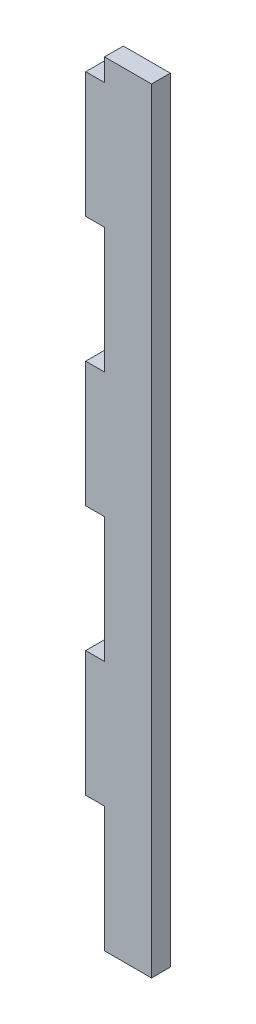
ISO-10303-21;
HEADER;
FILE_DESCRIPTION(('STEP AP214'),'2;1');
FILE_NAME('part.step','',(''),(''),'','','');
FILE_SCHEMA(('AUTOMOTIVE_DESIGN { 1 0 10303 214 1 1 1 1 }'));
ENDSEC;
DATA;
#1=APPLICATION_CONTEXT('core data for automotive mechanical design processes');
#2=APPLICATION_PROTOCOL_DEFINITION('international standard','automotive_design',2000,#1);
#3=PRODUCT_CONTEXT('',#1,'mechanical');
#4=PRODUCT('Part','Part','',(#3));
#5=PRODUCT_RELATED_PRODUCT_CATEGORY('part','',(#4));
#6=PRODUCT_DEFINITION_FORMATION('','',#4);
#7=PRODUCT_DEFINITION_CONTEXT('part definition',#1,'design');
#8=PRODUCT_DEFINITION('design','',#6,#7);
#9=PRODUCT_DEFINITION_SHAPE('','',#8);
#10=(LENGTH_UNIT() NAMED_UNIT(*) SI_UNIT(.MILLI.,.METRE.));
#11=(NAMED_UNIT(*) PLANE_ANGLE_UNIT() SI_UNIT($,.RADIAN.));
#12=(NAMED_UNIT(*) SI_UNIT($,.STERADIAN.) SOLID_ANGLE_UNIT());
#13=UNCERTAINTY_MEASURE_WITH_UNIT(LENGTH_MEASURE(1.E-05),#10,'distance_accuracy_value','');
#14=(GEOMETRIC_REPRESENTATION_CONTEXT(3) GLOBAL_UNCERTAINTY_ASSIGNED_CONTEXT((#13)) GLOBAL_UNIT_ASSIGNED_CONTEXT((#10,
#11,#12)) REPRESENTATION_CONTEXT('',''));
#15=CARTESIAN_POINT('',(0.,0.,0.));
#16=DIRECTION('',(0.,0.,1.));
#17=DIRECTION('',(1.,0.,0.));
#18=AXIS2_PLACEMENT_3D('',#15,#16,#17);
#19=CARTESIAN_POINT('',(2.64624382820718E-13,-25.6919761374694,-6.));
#20=DIRECTION('',(0.,-1.,0.));
#21=DIRECTION('',(1.,0.,0.));
#22=AXIS2_PLACEMENT_3D('',#19,#20,#21);
#23=PLANE('',#22);
#24=DIRECTION('',(1.,0.,0.));
#25=VECTOR('',#24,1.);
#26=CARTESIAN_POINT('',(2.64624382820718E-13,-25.6919761374694,0.));
#27=LINE('',#26,#25);
#28=CARTESIAN_POINT('',(-5.99999999999945,-25.6919761374694,0.));
#29=VERTEX_POINT('',#28);
#30=CARTESIAN_POINT('',(2.64624382820718E-13,-25.6919761374694,0.));
#31=VERTEX_POINT('',#30);
#32=EDGE_CURVE('E177',#29,#31,#27,.T.);
#33=ORIENTED_EDGE('',*,*,#32,.F.);
#34=DIRECTION('',(0.,0.,1.));
#35=VECTOR('',#34,1.);
#36=CARTESIAN_POINT('',(-5.99999999999945,-25.6919761374694,-6.));
#37=LINE('',#36,#35);
#38=CARTESIAN_POINT('',(-5.99999999999945,-25.6919761374694,-6.));
#39=VERTEX_POINT('',#38);
#40=EDGE_CURVE('E11',#39,#29,#37,.T.);
#41=ORIENTED_EDGE('',*,*,#40,.F.);
#42=DIRECTION('',(1.,0.,0.));
#43=VECTOR('',#42,1.);
#44=CARTESIAN_POINT('',(2.64624382820718E-13,-25.6919761374694,-6.));
#45=LINE('',#44,#43);
#46=CARTESIAN_POINT('',(2.64624382820718E-13,-25.6919761374694,-6.));
#47=VERTEX_POINT('',#46);
#48=EDGE_CURVE('E221',#39,#47,#45,.T.);
#49=ORIENTED_EDGE('',*,*,#48,.T.);
#50=DIRECTION('',(0.,0.,1.));
#51=VECTOR('',#50,1.);
#52=CARTESIAN_POINT('',(2.64624382820718E-13,-25.6919761374694,-6.));
#53=LINE('',#52,#51);
#54=EDGE_CURVE('E35',#47,#31,#53,.T.);
#55=ORIENTED_EDGE('',*,*,#54,.T.);
#56=EDGE_LOOP('',(#33,#41,#49,#55));
#57=FACE_BOUND('',#56,.T.);
#58=ADVANCED_FACE('F32',(#57),#23,.T.);
#59=CARTESIAN_POINT('',(-5.99999999999934,14.3068090031227,-6.));
#60=DIRECTION('',(-1.,0.,0.));
#61=DIRECTION('',(0.,-1.,0.));
#62=AXIS2_PLACEMENT_3D('',#59,#60,#61);
#63=PLANE('',#62);
#64=DIRECTION('',(0.,-1.,0.));
#65=VECTOR('',#64,1.);
#66=CARTESIAN_POINT('',(-5.99999999999934,14.3068090031227,0.));
#67=LINE('',#66,#65);
#68=CARTESIAN_POINT('',(-5.99999999999934,14.3068090031227,0.));
#69=VERTEX_POINT('',#68);
#70=EDGE_CURVE('E219',#69,#29,#67,.T.);
#71=ORIENTED_EDGE('',*,*,#70,.F.);
#72=DIRECTION('',(0.,0.,1.));
#73=VECTOR('',#72,1.);
#74=CARTESIAN_POINT('',(-5.99999999999934,14.3068090031227,-6.));
#75=LINE('',#74,#73);
#76=CARTESIAN_POINT('',(-5.99999999999934,14.3068090031227,-6.));
#77=VERTEX_POINT('',#76);
#78=EDGE_CURVE('E41',#77,#69,#75,.T.);
#79=ORIENTED_EDGE('',*,*,#78,.F.);
#80=DIRECTION('',(0.,-1.,0.));
#81=VECTOR('',#80,1.);
#82=CARTESIAN_POINT('',(-5.99999999999934,14.3068090031227,-6.));
#83=LINE('',#82,#81);
#84=EDGE_CURVE('E167',#77,#39,#83,.T.);
#85=ORIENTED_EDGE('',*,*,#84,.T.);
#86=ORIENTED_EDGE('',*,*,#40,.T.);
#87=EDGE_LOOP('',(#71,#79,#85,#86));
#88=FACE_BOUND('',#87,.T.);
#89=ADVANCED_FACE('F249',(#88),#63,.T.);
#90=CARTESIAN_POINT('',(-5.99999999999934,14.3068090031227,-6.));
#91=DIRECTION('',(0.,1.,0.));
#92=DIRECTION('',(-1.,0.,0.));
#93=AXIS2_PLACEMENT_3D('',#90,#91,#92);
#94=PLANE('',#93);
#95=DIRECTION('',(-1.,0.,0.));
#96=VECTOR('',#95,1.);
#97=CARTESIAN_POINT('',(-5.99999999999934,14.3068090031227,0.));
#98=LINE('',#97,#96);
#99=CARTESIAN_POINT('',(4.44089209850063E-13,14.3068090031227,0.));
#100=VERTEX_POINT('',#99);
#101=EDGE_CURVE('E154',#100,#69,#98,.T.);
#102=ORIENTED_EDGE('',*,*,#101,.F.);
#103=DIRECTION('',(0.,0.,1.));
#104=VECTOR('',#103,1.);
#105=CARTESIAN_POINT('',(4.44089209850063E-13,14.3068090031227,-6.));
#106=LINE('',#105,#104);
#107=CARTESIAN_POINT('',(4.44089209850063E-13,14.3068090031227,-6.));
#108=VERTEX_POINT('',#107);
#109=EDGE_CURVE('E149',#108,#100,#106,.T.);
#110=ORIENTED_EDGE('',*,*,#109,.F.);
#111=DIRECTION('',(-1.,0.,0.));
#112=VECTOR('',#111,1.);
#113=CARTESIAN_POINT('',(-5.99999999999934,14.3068090031227,-6.));
#114=LINE('',#113,#112);
#115=EDGE_CURVE('E152',#108,#77,#114,.T.);
#116=ORIENTED_EDGE('',*,*,#115,.T.);
#117=ORIENTED_EDGE('',*,*,#78,.T.);
#118=EDGE_LOOP('',(#102,#110,#116,#117));
#119=FACE_BOUND('',#118,.T.);
#120=ADVANCED_FACE('F151',(#119),#94,.T.);
#121=CARTESIAN_POINT('',(4.44089209850063E-13,14.3068090031227,-6.));
#122=DIRECTION('',(-1.,0.,0.));
#123=DIRECTION('',(0.,-1.,0.));
#124=AXIS2_PLACEMENT_3D('',#121,#122,#123);
#125=PLANE('',#124);
#126=DIRECTION('',(0.,-1.,0.));
#127=VECTOR('',#126,1.);
#128=CARTESIAN_POINT('',(4.44089209850063E-13,14.3068090031227,0.));
#129=LINE('',#128,#127);
#130=CARTESIAN_POINT('',(0.,54.3086312922345,0.));
#131=VERTEX_POINT('',#130);
#132=EDGE_CURVE('E216',#131,#100,#129,.T.);
#133=ORIENTED_EDGE('',*,*,#132,.F.);
#134=DIRECTION('',(0.,0.,1.));
#135=VECTOR('',#134,1.);
#136=CARTESIAN_POINT('',(0.,54.3086312922345,-6.));
#137=LINE('',#136,#135);
#138=CARTESIAN_POINT('',(0.,54.3086312922345,-6.));
#139=VERTEX_POINT('',#138);
#140=EDGE_CURVE('E159',#139,#131,#137,.T.);
#141=ORIENTED_EDGE('',*,*,#140,.F.);
#142=DIRECTION('',(0.,-1.,0.));
#143=VECTOR('',#142,1.);
#144=CARTESIAN_POINT('',(4.44089209850063E-13,14.3068090031227,-6.));
#145=LINE('',#144,#143);
#146=EDGE_CURVE('E165',#139,#108,#145,.T.);
#147=ORIENTED_EDGE('',*,*,#146,.T.);
#148=ORIENTED_EDGE('',*,*,#109,.T.);
#149=EDGE_LOOP('',(#133,#141,#147,#148));
#150=FACE_BOUND('',#149,.T.);
#151=ADVANCED_FACE('F169',(#150),#125,.T.);
#152=CARTESIAN_POINT('',(-5.99999999999973,54.3086312922345,-6.));
#153=DIRECTION('',(0.,-1.,0.));
#154=DIRECTION('',(0.,0.,-1.));
#155=AXIS2_PLACEMENT_3D('',#152,#153,#154);
#156=PLANE('',#155);
#157=DIRECTION('',(1.,0.,0.));
#158=VECTOR('',#157,1.);
#159=CARTESIAN_POINT('',(-5.99999999999973,54.3086312922345,0.));
#160=LINE('',#159,#158);
#161=CARTESIAN_POINT('',(-5.99999999999973,54.3086312922345,0.));
#162=VERTEX_POINT('',#161);
#163=EDGE_CURVE('E213',#162,#131,#160,.T.);
#164=ORIENTED_EDGE('',*,*,#163,.F.);
#165=DIRECTION('',(0.,0.,1.));
#166=VECTOR('',#165,1.);
#167=CARTESIAN_POINT('',(-5.99999999999973,54.3086312922345,-6.));
#168=LINE('',#167,#166);
#169=CARTESIAN_POINT('',(-5.99999999999973,54.3086312922345,-6.));
#170=VERTEX_POINT('',#169);
#171=EDGE_CURVE('E225',#170,#162,#168,.T.);
#172=ORIENTED_EDGE('',*,*,#171,.F.);
#173=DIRECTION('',(1.,0.,0.));
#174=VECTOR('',#173,1.);
#175=CARTESIAN_POINT('',(-5.99999999999973,54.3086312922345,-6.));
#176=LINE('',#175,#174);
#177=EDGE_CURVE('E170',#170,#139,#176,.T.);
#178=ORIENTED_EDGE('',*,*,#177,.T.);
#179=ORIENTED_EDGE('',*,*,#140,.T.);
#180=EDGE_LOOP('',(#164,#172,#178,#179));
#181=FACE_BOUND('',#180,.T.);
#182=ADVANCED_FACE('F262',(#181),#156,.T.);
#183=CARTESIAN_POINT('',(-5.99999999999961,94.3074164328267,-6.));
#184=DIRECTION('',(-1.,0.,0.));
#185=DIRECTION('',(0.,-1.,0.));
#186=AXIS2_PLACEMENT_3D('',#183,#184,#185);
#187=PLANE('',#186);
#188=DIRECTION('',(0.,-1.,0.));
#189=VECTOR('',#188,1.);
#190=CARTESIAN_POINT('',(-5.99999999999961,94.3074164328267,0.));
#191=LINE('',#190,#189);
#192=CARTESIAN_POINT('',(-5.99999999999961,94.3074164328267,0.));
#193=VERTEX_POINT('',#192);
#194=EDGE_CURVE('E210',#193,#162,#191,.T.);
#195=ORIENTED_EDGE('',*,*,#194,.F.);
#196=DIRECTION('',(0.,0.,1.));
#197=VECTOR('',#196,1.);
#198=CARTESIAN_POINT('',(-5.99999999999961,94.3074164328267,-6.));
#199=LINE('',#198,#197);
#200=CARTESIAN_POINT('',(-5.99999999999961,94.3074164328267,-6.));
#201=VERTEX_POINT('',#200);
#202=EDGE_CURVE('E227',#201,#193,#199,.T.);
#203=ORIENTED_EDGE('',*,*,#202,.F.);
#204=DIRECTION('',(0.,-1.,0.));
#205=VECTOR('',#204,1.);
#206=CARTESIAN_POINT('',(-5.99999999999961,94.3074164328267,-6.));
#207=LINE('',#206,#205);
#208=EDGE_CURVE('E172',#201,#170,#207,.T.);
#209=ORIENTED_EDGE('',*,*,#208,.T.);
#210=ORIENTED_EDGE('',*,*,#171,.T.);
#211=EDGE_LOOP('',(#195,#203,#209,#210));
#212=FACE_BOUND('',#211,.T.);
#213=ADVANCED_FACE('F265',(#212),#187,.T.);
#214=CARTESIAN_POINT('',(-5.99999999999961,94.3074164328267,-6.));
#215=DIRECTION('',(0.,1.,0.));
#216=DIRECTION('',(0.,0.,1.));
#217=AXIS2_PLACEMENT_3D('',#214,#215,#216);
#218=PLANE('',#217);
#219=DIRECTION('',(-1.,0.,0.));
#220=VECTOR('',#219,1.);
#221=CARTESIAN_POINT('',(-5.99999999999961,94.3074164328267,0.));
#222=LINE('',#221,#220);
#223=CARTESIAN_POINT('',(1.69667206304067E-13,94.3074164328267,0.));
#224=VERTEX_POINT('',#223);
#225=EDGE_CURVE('E207',#224,#193,#222,.T.);
#226=ORIENTED_EDGE('',*,*,#225,.F.);
#227=DIRECTION('',(0.,0.,1.));
#228=VECTOR('',#227,1.);
#229=CARTESIAN_POINT('',(1.69667206304067E-13,94.3074164328267,-6.));
#230=LINE('',#229,#228);
#231=CARTESIAN_POINT('',(1.69667206304067E-13,94.3074164328267,-6.));
#232=VERTEX_POINT('',#231);
#233=EDGE_CURVE('E229',#232,#224,#230,.T.);
#234=ORIENTED_EDGE('',*,*,#233,.F.);
#235=DIRECTION('',(-1.,0.,0.));
#236=VECTOR('',#235,1.);
#237=CARTESIAN_POINT('',(-5.99999999999961,94.3074164328267,-6.));
#238=LINE('',#237,#236);
#239=EDGE_CURVE('E446',#232,#201,#238,.T.);
#240=ORIENTED_EDGE('',*,*,#239,.T.);
#241=ORIENTED_EDGE('',*,*,#202,.T.);
#242=EDGE_LOOP('',(#226,#234,#240,#241));
#243=FACE_BOUND('',#242,.T.);
#244=ADVANCED_FACE('F269',(#243),#218,.T.);
#245=CARTESIAN_POINT('',(1.69667206304067E-13,94.3074164328267,-6.));
#246=DIRECTION('',(-1.,0.,0.));
#247=DIRECTION('',(0.,-1.,0.));
#248=AXIS2_PLACEMENT_3D('',#245,#246,#247);
#249=PLANE('',#248);
#250=DIRECTION('',(0.,-1.,0.));
#251=VECTOR('',#250,1.);
#252=CARTESIAN_POINT('',(1.69667206304067E-13,94.3074164328267,0.));
#253=LINE('',#252,#251);
#254=CARTESIAN_POINT('',(-2.8421962427128E-13,134.309238721938,0.));
#255=VERTEX_POINT('',#254);
#256=EDGE_CURVE('E204',#255,#224,#253,.T.);
#257=ORIENTED_EDGE('',*,*,#256,.F.);
#258=DIRECTION('',(0.,0.,1.));
#259=VECTOR('',#258,1.);
#260=CARTESIAN_POINT('',(-2.8421962427128E-13,134.309238721938,-6.));
#261=LINE('',#260,#259);
#262=CARTESIAN_POINT('',(-2.8421962427128E-13,134.309238721938,-6.));
#263=VERTEX_POINT('',#262);
#264=EDGE_CURVE('E231',#263,#255,#261,.T.);
#265=ORIENTED_EDGE('',*,*,#264,.F.);
#266=DIRECTION('',(0.,-1.,0.));
#267=VECTOR('',#266,1.);
#268=CARTESIAN_POINT('',(1.69667206304067E-13,94.3074164328267,-6.));
#269=LINE('',#268,#267);
#270=EDGE_CURVE('E442',#263,#232,#269,.T.);
#271=ORIENTED_EDGE('',*,*,#270,.T.);
#272=ORIENTED_EDGE('',*,*,#233,.T.);
#273=EDGE_LOOP('',(#257,#265,#271,#272));
#274=FACE_BOUND('',#273,.T.);
#275=ADVANCED_FACE('F273',(#274),#249,.T.);
#276=CARTESIAN_POINT('',(-6.,134.309238721938,-6.));
#277=DIRECTION('',(0.,-1.,0.));
#278=DIRECTION('',(0.,0.,-1.));
#279=AXIS2_PLACEMENT_3D('',#276,#277,#278);
#280=PLANE('',#279);
#281=DIRECTION('',(1.,0.,0.));
#282=VECTOR('',#281,1.);
#283=CARTESIAN_POINT('',(-6.,134.309238721938,0.));
#284=LINE('',#283,#282);
#285=CARTESIAN_POINT('',(-6.,134.309238721938,0.));
#286=VERTEX_POINT('',#285);
#287=EDGE_CURVE('E201',#286,#255,#284,.T.);
#288=ORIENTED_EDGE('',*,*,#287,.F.);
#289=DIRECTION('',(0.,0.,1.));
#290=VECTOR('',#289,1.);
#291=CARTESIAN_POINT('',(-6.,134.309238721938,-6.));
#292=LINE('',#291,#290);
#293=CARTESIAN_POINT('',(-6.,134.309238721938,-6.));
#294=VERTEX_POINT('',#293);
#295=EDGE_CURVE('E233',#294,#286,#292,.T.);
#296=ORIENTED_EDGE('',*,*,#295,.F.);
#297=DIRECTION('',(1.,0.,0.));
#298=VECTOR('',#297,1.);
#299=CARTESIAN_POINT('',(-6.,134.309238721938,-6.));
#300=LINE('',#299,#298);
#301=EDGE_CURVE('E453',#294,#263,#300,.T.);
#302=ORIENTED_EDGE('',*,*,#301,.T.);
#303=ORIENTED_EDGE('',*,*,#264,.T.);
#304=EDGE_LOOP('',(#288,#296,#302,#303));
#305=FACE_BOUND('',#304,.T.);
#306=ADVANCED_FACE('F277',(#305),#280,.T.);
#307=CARTESIAN_POINT('',(-5.99999999999989,174.308023862531,-6.));
#308=DIRECTION('',(-1.,0.,0.));
#309=DIRECTION('',(0.,-1.,0.));
#310=AXIS2_PLACEMENT_3D('',#307,#308,#309);
#311=PLANE('',#310);
#312=DIRECTION('',(0.,-1.,0.));
#313=VECTOR('',#312,1.);
#314=CARTESIAN_POINT('',(-5.99999999999989,174.308023862531,0.));
#315=LINE('',#314,#313);
#316=CARTESIAN_POINT('',(-5.99999999999989,174.308023862531,0.));
#317=VERTEX_POINT('',#316);
#318=EDGE_CURVE('E198',#317,#286,#315,.T.);
#319=ORIENTED_EDGE('',*,*,#318,.F.);
#320=DIRECTION('',(0.,0.,1.));
#321=VECTOR('',#320,1.);
#322=CARTESIAN_POINT('',(-5.99999999999989,174.308023862531,-6.));
#323=LINE('',#322,#321);
#324=CARTESIAN_POINT('',(-5.99999999999989,174.308023862531,-6.));
#325=VERTEX_POINT('',#324);
#326=EDGE_CURVE('E235',#325,#317,#323,.T.);
#327=ORIENTED_EDGE('',*,*,#326,.F.);
#328=DIRECTION('',(0.,-1.,0.));
#329=VECTOR('',#328,1.);
#330=CARTESIAN_POINT('',(-5.99999999999989,174.308023862531,-6.));
#331=LINE('',#330,#329);
#332=EDGE_CURVE('E435',#325,#294,#331,.T.);
#333=ORIENTED_EDGE('',*,*,#332,.T.);
#334=ORIENTED_EDGE('',*,*,#295,.T.);
#335=EDGE_LOOP('',(#319,#327,#333,#334));
#336=FACE_BOUND('',#335,.T.);
#337=ADVANCED_FACE('F281',(#336),#311,.T.);
#338=CARTESIAN_POINT('',(-5.99999999999989,174.308023862531,-6.));
#339=DIRECTION('',(0.,1.,0.));
#340=DIRECTION('',(-1.,0.,0.));
#341=AXIS2_PLACEMENT_3D('',#338,#339,#340);
#342=PLANE('',#341);
#343=DIRECTION('',(-1.,0.,0.));
#344=VECTOR('',#343,1.);
#345=CARTESIAN_POINT('',(-5.99999999999989,174.308023862531,0.));
#346=LINE('',#345,#344);
#347=CARTESIAN_POINT('',(0.,174.308023862531,0.));
#348=VERTEX_POINT('',#347);
#349=EDGE_CURVE('E195',#348,#317,#346,.T.);
#350=ORIENTED_EDGE('',*,*,#349,.F.);
#351=DIRECTION('',(0.,0.,1.));
#352=VECTOR('',#351,1.);
#353=CARTESIAN_POINT('',(0.,174.308023862531,-6.));
#354=LINE('',#353,#352);
#355=CARTESIAN_POINT('',(0.,174.308023862531,-6.));
#356=VERTEX_POINT('',#355);
#357=EDGE_CURVE('E237',#356,#348,#354,.T.);
#358=ORIENTED_EDGE('',*,*,#357,.F.);
#359=DIRECTION('',(-1.,0.,0.));
#360=VECTOR('',#359,1.);
#361=CARTESIAN_POINT('',(-5.99999999999989,174.308023862531,-6.));
#362=LINE('',#361,#360);
#363=EDGE_CURVE('E431',#356,#325,#362,.T.);
#364=ORIENTED_EDGE('',*,*,#363,.T.);
#365=ORIENTED_EDGE('',*,*,#326,.T.);
#366=EDGE_LOOP('',(#350,#358,#364,#365));
#367=FACE_BOUND('',#366,.T.);
#368=ADVANCED_FACE('F285',(#367),#342,.T.);
#369=CARTESIAN_POINT('',(0.,181.409908734668,-6.));
#370=DIRECTION('',(-1.,0.,0.));
#371=DIRECTION('',(0.,-1.,0.));
#372=AXIS2_PLACEMENT_3D('',#369,#370,#371);
#373=PLANE('',#372);
#374=DIRECTION('',(0.,-1.,0.));
#375=VECTOR('',#374,1.);
#376=CARTESIAN_POINT('',(0.,181.409908734668,0.));
#377=LINE('',#376,#375);
#378=CARTESIAN_POINT('',(0.,181.409908734668,0.));
#379=VERTEX_POINT('',#378);
#380=EDGE_CURVE('E192',#379,#348,#377,.T.);
#381=ORIENTED_EDGE('',*,*,#380,.F.);
#382=DIRECTION('',(0.,0.,1.));
#383=VECTOR('',#382,1.);
#384=CARTESIAN_POINT('',(0.,181.409908734668,-6.));
#385=LINE('',#384,#383);
#386=CARTESIAN_POINT('',(0.,181.409908734668,-6.));
#387=VERTEX_POINT('',#386);
#388=EDGE_CURVE('E239',#387,#379,#385,.T.);
#389=ORIENTED_EDGE('',*,*,#388,.F.);
#390=DIRECTION('',(0.,-1.,0.));
#391=VECTOR('',#390,1.);
#392=CARTESIAN_POINT('',(0.,181.409908734668,-6.));
#393=LINE('',#392,#391);
#394=EDGE_CURVE('E457',#387,#356,#393,.T.);
#395=ORIENTED_EDGE('',*,*,#394,.T.);
#396=ORIENTED_EDGE('',*,*,#357,.T.);
#397=EDGE_LOOP('',(#381,#389,#395,#396));
#398=FACE_BOUND('',#397,.T.);
#399=ADVANCED_FACE('F289',(#398),#373,.T.);
#400=CARTESIAN_POINT('',(0.,181.409908734668,-6.));
#401=DIRECTION('',(1.01770443923973E-13,1.,0.));
#402=DIRECTION('',(-1.,1.01770443923973E-13,0.));
#403=AXIS2_PLACEMENT_3D('',#400,#401,#402);
#404=PLANE('',#403);
#405=DIRECTION('',(-1.,1.01770443923973E-13,0.));
#406=VECTOR('',#405,1.);
#407=CARTESIAN_POINT('',(0.,181.409908734668,0.));
#408=LINE('',#407,#406);
#409=CARTESIAN_POINT('',(15.,181.409908734666,0.));
#410=VERTEX_POINT('',#409);
#411=EDGE_CURVE('E189',#410,#379,#408,.T.);
#412=ORIENTED_EDGE('',*,*,#411,.F.);
#413=DIRECTION('',(0.,0.,1.));
#414=VECTOR('',#413,1.);
#415=CARTESIAN_POINT('',(15.,181.409908734666,-6.));
#416=LINE('',#415,#414);
#417=CARTESIAN_POINT('',(15.,181.409908734666,-6.));
#418=VERTEX_POINT('',#417);
#419=EDGE_CURVE('E241',#418,#410,#416,.T.);
#420=ORIENTED_EDGE('',*,*,#419,.F.);
#421=DIRECTION('',(-1.,1.01770443923973E-13,0.));
#422=VECTOR('',#421,1.);
#423=CARTESIAN_POINT('',(0.,181.409908734668,-6.));
#424=LINE('',#423,#422);
#425=EDGE_CURVE('E424',#418,#387,#424,.T.);
#426=ORIENTED_EDGE('',*,*,#425,.T.);
#427=ORIENTED_EDGE('',*,*,#388,.T.);
#428=EDGE_LOOP('',(#412,#420,#426,#427));
#429=FACE_BOUND('',#428,.T.);
#430=ADVANCED_FACE('F293',(#429),#404,.T.);
#431=CARTESIAN_POINT('',(15.,181.409908734666,-6.));
#432=DIRECTION('',(1.,0.,0.));
#433=DIRECTION('',(0.,1.,0.));
#434=AXIS2_PLACEMENT_3D('',#431,#432,#433);
#435=PLANE('',#434);
#436=DIRECTION('',(0.,1.,0.));
#437=VECTOR('',#436,1.);
#438=CARTESIAN_POINT('',(15.,181.409908734666,0.));
#439=LINE('',#438,#437);
#440=CARTESIAN_POINT('',(14.9999999999983,-65.6937984265812,0.));
#441=VERTEX_POINT('',#440);
#442=EDGE_CURVE('E186',#441,#410,#439,.T.);
#443=ORIENTED_EDGE('',*,*,#442,.F.);
#444=DIRECTION('',(0.,0.,1.));
#445=VECTOR('',#444,1.);
#446=CARTESIAN_POINT('',(14.9999999999983,-65.6937984265812,-6.));
#447=LINE('',#446,#445);
#448=CARTESIAN_POINT('',(14.9999999999983,-65.6937984265812,-6.));
#449=VERTEX_POINT('',#448);
#450=EDGE_CURVE('E243',#449,#441,#447,.T.);
#451=ORIENTED_EDGE('',*,*,#450,.F.);
#452=DIRECTION('',(0.,1.,0.));
#453=VECTOR('',#452,1.);
#454=CARTESIAN_POINT('',(15.,181.409908734666,-6.));
#455=LINE('',#454,#453);
#456=EDGE_CURVE('E420',#449,#418,#455,.T.);
#457=ORIENTED_EDGE('',*,*,#456,.T.);
#458=ORIENTED_EDGE('',*,*,#419,.T.);
#459=EDGE_LOOP('',(#443,#451,#457,#458));
#460=FACE_BOUND('',#459,.T.);
#461=ADVANCED_FACE('F297',(#460),#435,.T.);
#462=CARTESIAN_POINT('',(14.9999999999983,-65.6937984265812,-6.));
#463=DIRECTION('',(0.,-1.,0.));
#464=DIRECTION('',(0.,0.,-1.));
#465=AXIS2_PLACEMENT_3D('',#462,#463,#464);
#466=PLANE('',#465);
#467=DIRECTION('',(1.,0.,0.));
#468=VECTOR('',#467,1.);
#469=CARTESIAN_POINT('',(14.9999999999983,-65.6937984265812,0.));
#470=LINE('',#469,#468);
#471=CARTESIAN_POINT('',(7.18511213396058E-13,-65.6937984265812,0.));
#472=VERTEX_POINT('',#471);
#473=EDGE_CURVE('E183',#472,#441,#470,.T.);
#474=ORIENTED_EDGE('',*,*,#473,.F.);
#475=DIRECTION('',(0.,0.,1.));
#476=VECTOR('',#475,1.);
#477=CARTESIAN_POINT('',(7.18511213396058E-13,-65.6937984265812,-6.));
#478=LINE('',#477,#476);
#479=CARTESIAN_POINT('',(7.18511213396058E-13,-65.6937984265812,-6.));
#480=VERTEX_POINT('',#479);
#481=EDGE_CURVE('E244',#480,#472,#478,.T.);
#482=ORIENTED_EDGE('',*,*,#481,.F.);
#483=DIRECTION('',(1.,0.,0.));
#484=VECTOR('',#483,1.);
#485=CARTESIAN_POINT('',(14.9999999999983,-65.6937984265812,-6.));
#486=LINE('',#485,#484);
#487=EDGE_CURVE('E461',#480,#449,#486,.T.);
#488=ORIENTED_EDGE('',*,*,#487,.T.);
#489=ORIENTED_EDGE('',*,*,#450,.T.);
#490=EDGE_LOOP('',(#474,#482,#488,#489));
#491=FACE_BOUND('',#490,.T.);
#492=ADVANCED_FACE('F301',(#491),#466,.T.);
#493=CARTESIAN_POINT('',(7.18511213396058E-13,-65.6937984265812,-6.));
#494=DIRECTION('',(-1.,0.,0.));
#495=DIRECTION('',(0.,-1.,0.));
#496=AXIS2_PLACEMENT_3D('',#493,#494,#495);
#497=PLANE('',#496);
#498=DIRECTION('',(0.,-1.,0.));
#499=VECTOR('',#498,1.);
#500=CARTESIAN_POINT('',(7.18511213396058E-13,-65.6937984265812,0.));
#501=LINE('',#500,#499);
#502=EDGE_CURVE('E180',#31,#472,#501,.T.);
#503=ORIENTED_EDGE('',*,*,#502,.F.);
#504=ORIENTED_EDGE('',*,*,#54,.F.);
#505=DIRECTION('',(0.,-1.,0.));
#506=VECTOR('',#505,1.);
#507=CARTESIAN_POINT('',(7.18511213396058E-13,-65.6937984265812,-6.));
#508=LINE('',#507,#506);
#509=EDGE_CURVE('E463',#47,#480,#508,.T.);
#510=ORIENTED_EDGE('',*,*,#509,.T.);
#511=ORIENTED_EDGE('',*,*,#481,.T.);
#512=EDGE_LOOP('',(#503,#504,#510,#511));
#513=FACE_BOUND('',#512,.T.);
#514=ADVANCED_FACE('F246',(#513),#497,.T.);
#515=CARTESIAN_POINT('',(0.,0.,-6.));
#516=DIRECTION('',(0.,0.,1.));
#517=DIRECTION('',(1.,0.,0.));
#518=AXIS2_PLACEMENT_3D('',#515,#516,#517);
#519=PLANE('',#518);
#520=ORIENTED_EDGE('',*,*,#48,.F.);
#521=ORIENTED_EDGE('',*,*,#84,.F.);
#522=ORIENTED_EDGE('',*,*,#115,.F.);
#523=ORIENTED_EDGE('',*,*,#146,.F.);
#524=ORIENTED_EDGE('',*,*,#177,.F.);
#525=ORIENTED_EDGE('',*,*,#208,.F.);
#526=ORIENTED_EDGE('',*,*,#239,.F.);
#527=ORIENTED_EDGE('',*,*,#270,.F.);
#528=ORIENTED_EDGE('',*,*,#301,.F.);
#529=ORIENTED_EDGE('',*,*,#332,.F.);
#530=ORIENTED_EDGE('',*,*,#363,.F.);
#531=ORIENTED_EDGE('',*,*,#394,.F.);
#532=ORIENTED_EDGE('',*,*,#425,.F.);
#533=ORIENTED_EDGE('',*,*,#456,.F.);
#534=ORIENTED_EDGE('',*,*,#487,.F.);
#535=ORIENTED_EDGE('',*,*,#509,.F.);
#536=EDGE_LOOP('',(#520,#521,#522,#523,#524,#525,#526,#527,#528,#529,#530,#531,#532,#533,#534,#535));
#537=FACE_BOUND('',#536,.T.);
#538=ADVANCED_FACE('F163',(#537),#519,.F.);
#539=CARTESIAN_POINT('',(0.,0.,0.));
#540=DIRECTION('',(0.,0.,1.));
#541=DIRECTION('',(1.,0.,0.));
#542=AXIS2_PLACEMENT_3D('',#539,#540,#541);
#543=PLANE('',#542);
#544=ORIENTED_EDGE('',*,*,#32,.T.);
#545=ORIENTED_EDGE('',*,*,#502,.T.);
#546=ORIENTED_EDGE('',*,*,#473,.T.);
#547=ORIENTED_EDGE('',*,*,#442,.T.);
#548=ORIENTED_EDGE('',*,*,#411,.T.);
#549=ORIENTED_EDGE('',*,*,#380,.T.);
#550=ORIENTED_EDGE('',*,*,#349,.T.);
#551=ORIENTED_EDGE('',*,*,#318,.T.);
#552=ORIENTED_EDGE('',*,*,#287,.T.);
#553=ORIENTED_EDGE('',*,*,#256,.T.);
#554=ORIENTED_EDGE('',*,*,#225,.T.);
#555=ORIENTED_EDGE('',*,*,#194,.T.);
#556=ORIENTED_EDGE('',*,*,#163,.T.);
#557=ORIENTED_EDGE('',*,*,#132,.T.);
#558=ORIENTED_EDGE('',*,*,#101,.T.);
#559=ORIENTED_EDGE('',*,*,#70,.T.);
#560=EDGE_LOOP('',(#544,#545,#546,#547,#548,#549,#550,#551,#552,#553,#554,#555,#556,#557,#558,#559));
#561=FACE_BOUND('',#560,.T.);
#562=ADVANCED_FACE('F248',(#561),#543,.T.);
#563=CLOSED_SHELL('',(#58,#89,#120,#151,#182,#213,#244,#275,#306,#337,#368,#399,#430,#461,#492,
#514,#538,#562));
#564=MANIFOLD_SOLID_BREP('B2',#563);
#565=ADVANCED_BREP_SHAPE_REPRESENTATION('',(#18,#564),#14);
#566=SHAPE_DEFINITION_REPRESENTATION(#9,#565);
ENDSEC;
END-ISO-10303-21;
